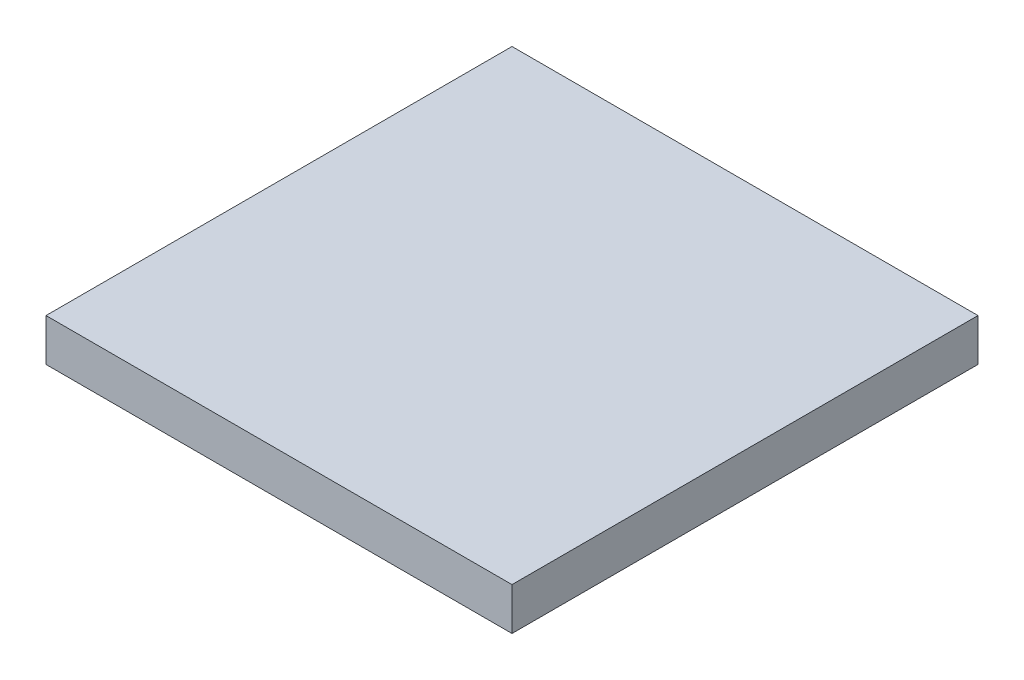
ISO-10303-21;
HEADER;
FILE_DESCRIPTION(('STEP AP214'),'2;1');
FILE_NAME('part.step','',(''),(''),'','','');
FILE_SCHEMA(('AUTOMOTIVE_DESIGN { 1 0 10303 214 1 1 1 1 }'));
ENDSEC;
DATA;
#1=APPLICATION_CONTEXT('core data for automotive mechanical design processes');
#2=APPLICATION_PROTOCOL_DEFINITION('international standard','automotive_design',2000,#1);
#3=PRODUCT_CONTEXT('',#1,'mechanical');
#4=PRODUCT('Part','Part','',(#3));
#5=PRODUCT_RELATED_PRODUCT_CATEGORY('part','',(#4));
#6=PRODUCT_DEFINITION_FORMATION('','',#4);
#7=PRODUCT_DEFINITION_CONTEXT('part definition',#1,'design');
#8=PRODUCT_DEFINITION('design','',#6,#7);
#9=PRODUCT_DEFINITION_SHAPE('','',#8);
#10=(LENGTH_UNIT() NAMED_UNIT(*) SI_UNIT(.MILLI.,.METRE.));
#11=(NAMED_UNIT(*) PLANE_ANGLE_UNIT() SI_UNIT($,.RADIAN.));
#12=(NAMED_UNIT(*) SI_UNIT($,.STERADIAN.) SOLID_ANGLE_UNIT());
#13=UNCERTAINTY_MEASURE_WITH_UNIT(LENGTH_MEASURE(1.E-05),#10,'distance_accuracy_value','');
#14=(GEOMETRIC_REPRESENTATION_CONTEXT(3) GLOBAL_UNCERTAINTY_ASSIGNED_CONTEXT((#13)) GLOBAL_UNIT_ASSIGNED_CONTEXT((#10,
#11,#12)) REPRESENTATION_CONTEXT('',''));
#15=CARTESIAN_POINT('',(0.,0.,0.));
#16=DIRECTION('',(0.,0.,1.));
#17=DIRECTION('',(1.,0.,0.));
#18=AXIS2_PLACEMENT_3D('',#15,#16,#17);
#19=CARTESIAN_POINT('',(8.25000000000001,1.5,16.5));
#20=DIRECTION('',(-1.,0.,0.));
#21=DIRECTION('',(0.,0.,1.));
#22=AXIS2_PLACEMENT_3D('',#19,#20,#21);
#23=PLANE('',#22);
#24=DIRECTION('',(0.,0.,-1.));
#25=VECTOR('',#24,1.);
#26=CARTESIAN_POINT('',(8.25000000000001,0.,16.5));
#27=LINE('',#26,#25);
#28=CARTESIAN_POINT('',(8.25000000000001,0.,16.5));
#29=VERTEX_POINT('',#28);
#30=CARTESIAN_POINT('',(8.25,0.,0.));
#31=VERTEX_POINT('',#30);
#32=EDGE_CURVE('E111',#29,#31,#27,.T.);
#33=ORIENTED_EDGE('',*,*,#32,.T.);
#34=DIRECTION('',(0.,-1.,0.));
#35=VECTOR('',#34,1.);
#36=CARTESIAN_POINT('',(8.25,1.5,0.));
#37=LINE('',#36,#35);
#38=CARTESIAN_POINT('',(8.25,1.5,0.));
#39=VERTEX_POINT('',#38);
#40=EDGE_CURVE('E11',#39,#31,#37,.T.);
#41=ORIENTED_EDGE('',*,*,#40,.F.);
#42=DIRECTION('',(0.,0.,-1.));
#43=VECTOR('',#42,1.);
#44=CARTESIAN_POINT('',(8.25000000000001,1.5,16.5));
#45=LINE('',#44,#43);
#46=CARTESIAN_POINT('',(8.25000000000001,1.5,16.5));
#47=VERTEX_POINT('',#46);
#48=EDGE_CURVE('E95',#47,#39,#45,.T.);
#49=ORIENTED_EDGE('',*,*,#48,.F.);
#50=DIRECTION('',(0.,-1.,0.));
#51=VECTOR('',#50,1.);
#52=CARTESIAN_POINT('',(8.25000000000001,1.5,16.5));
#53=LINE('',#52,#51);
#54=EDGE_CURVE('E107',#47,#29,#53,.T.);
#55=ORIENTED_EDGE('',*,*,#54,.T.);
#56=EDGE_LOOP('',(#33,#41,#49,#55));
#57=FACE_BOUND('',#56,.T.);
#58=ADVANCED_FACE('F43',(#57),#23,.F.);
#59=CARTESIAN_POINT('',(8.25,1.5,0.));
#60=DIRECTION('',(0.,0.,1.));
#61=DIRECTION('',(1.,0.,0.));
#62=AXIS2_PLACEMENT_3D('',#59,#60,#61);
#63=PLANE('',#62);
#64=DIRECTION('',(-1.,0.,0.));
#65=VECTOR('',#64,1.);
#66=CARTESIAN_POINT('',(8.25,0.,0.));
#67=LINE('',#66,#65);
#68=CARTESIAN_POINT('',(-8.25,0.,0.));
#69=VERTEX_POINT('',#68);
#70=EDGE_CURVE('E100',#31,#69,#67,.T.);
#71=ORIENTED_EDGE('',*,*,#70,.T.);
#72=DIRECTION('',(0.,-1.,0.));
#73=VECTOR('',#72,1.);
#74=CARTESIAN_POINT('',(-8.25,1.5,0.));
#75=LINE('',#74,#73);
#76=CARTESIAN_POINT('',(-8.25,1.5,0.));
#77=VERTEX_POINT('',#76);
#78=EDGE_CURVE('E52',#77,#69,#75,.T.);
#79=ORIENTED_EDGE('',*,*,#78,.F.);
#80=DIRECTION('',(-1.,0.,0.));
#81=VECTOR('',#80,1.);
#82=CARTESIAN_POINT('',(8.25,1.5,0.));
#83=LINE('',#82,#81);
#84=EDGE_CURVE('E90',#39,#77,#83,.T.);
#85=ORIENTED_EDGE('',*,*,#84,.F.);
#86=ORIENTED_EDGE('',*,*,#40,.T.);
#87=EDGE_LOOP('',(#71,#79,#85,#86));
#88=FACE_BOUND('',#87,.T.);
#89=ADVANCED_FACE('F99',(#88),#63,.F.);
#90=CARTESIAN_POINT('',(-8.25,1.5,0.));
#91=DIRECTION('',(1.,0.,0.));
#92=DIRECTION('',(0.,0.,-1.));
#93=AXIS2_PLACEMENT_3D('',#90,#91,#92);
#94=PLANE('',#93);
#95=DIRECTION('',(0.,0.,1.));
#96=VECTOR('',#95,1.);
#97=CARTESIAN_POINT('',(-8.25,0.,0.));
#98=LINE('',#97,#96);
#99=CARTESIAN_POINT('',(-8.25,0.,16.5));
#100=VERTEX_POINT('',#99);
#101=EDGE_CURVE('E77',#69,#100,#98,.T.);
#102=ORIENTED_EDGE('',*,*,#101,.T.);
#103=DIRECTION('',(0.,-1.,0.));
#104=VECTOR('',#103,1.);
#105=CARTESIAN_POINT('',(-8.25,1.5,16.5));
#106=LINE('',#105,#104);
#107=CARTESIAN_POINT('',(-8.25,1.5,16.5));
#108=VERTEX_POINT('',#107);
#109=EDGE_CURVE('E102',#108,#100,#106,.T.);
#110=ORIENTED_EDGE('',*,*,#109,.F.);
#111=DIRECTION('',(0.,0.,1.));
#112=VECTOR('',#111,1.);
#113=CARTESIAN_POINT('',(-8.25,1.5,0.));
#114=LINE('',#113,#112);
#115=EDGE_CURVE('E93',#77,#108,#114,.T.);
#116=ORIENTED_EDGE('',*,*,#115,.F.);
#117=ORIENTED_EDGE('',*,*,#78,.T.);
#118=EDGE_LOOP('',(#102,#110,#116,#117));
#119=FACE_BOUND('',#118,.T.);
#120=ADVANCED_FACE('F103',(#119),#94,.F.);
#121=CARTESIAN_POINT('',(-8.25,1.5,16.5));
#122=DIRECTION('',(0.,0.,-1.));
#123=DIRECTION('',(-1.,0.,0.));
#124=AXIS2_PLACEMENT_3D('',#121,#122,#123);
#125=PLANE('',#124);
#126=DIRECTION('',(1.,0.,0.));
#127=VECTOR('',#126,1.);
#128=CARTESIAN_POINT('',(-8.25,0.,16.5));
#129=LINE('',#128,#127);
#130=EDGE_CURVE('E83',#100,#29,#129,.T.);
#131=ORIENTED_EDGE('',*,*,#130,.T.);
#132=ORIENTED_EDGE('',*,*,#54,.F.);
#133=DIRECTION('',(1.,0.,0.));
#134=VECTOR('',#133,1.);
#135=CARTESIAN_POINT('',(-8.25,1.5,16.5));
#136=LINE('',#135,#134);
#137=EDGE_CURVE('E60',#108,#47,#136,.T.);
#138=ORIENTED_EDGE('',*,*,#137,.F.);
#139=ORIENTED_EDGE('',*,*,#109,.T.);
#140=EDGE_LOOP('',(#131,#132,#138,#139));
#141=FACE_BOUND('',#140,.T.);
#142=ADVANCED_FACE('F124',(#141),#125,.F.);
#143=CARTESIAN_POINT('',(0.,1.5,0.));
#144=DIRECTION('',(0.,1.,0.));
#145=DIRECTION('',(0.,0.,1.));
#146=AXIS2_PLACEMENT_3D('',#143,#144,#145);
#147=PLANE('',#146);
#148=ORIENTED_EDGE('',*,*,#48,.T.);
#149=ORIENTED_EDGE('',*,*,#84,.T.);
#150=ORIENTED_EDGE('',*,*,#115,.T.);
#151=ORIENTED_EDGE('',*,*,#137,.T.);
#152=EDGE_LOOP('',(#148,#149,#150,#151));
#153=FACE_BOUND('',#152,.T.);
#154=ADVANCED_FACE('F91',(#153),#147,.T.);
#155=CARTESIAN_POINT('',(0.,0.,0.));
#156=DIRECTION('',(0.,1.,0.));
#157=DIRECTION('',(0.,0.,1.));
#158=AXIS2_PLACEMENT_3D('',#155,#156,#157);
#159=PLANE('',#158);
#160=ORIENTED_EDGE('',*,*,#32,.F.);
#161=ORIENTED_EDGE('',*,*,#130,.F.);
#162=ORIENTED_EDGE('',*,*,#101,.F.);
#163=ORIENTED_EDGE('',*,*,#70,.F.);
#164=EDGE_LOOP('',(#160,#161,#162,#163));
#165=FACE_BOUND('',#164,.T.);
#166=ADVANCED_FACE('F127',(#165),#159,.F.);
#167=CLOSED_SHELL('',(#58,#89,#120,#142,#154,#166));
#168=MANIFOLD_SOLID_BREP('B2',#167);
#169=ADVANCED_BREP_SHAPE_REPRESENTATION('',(#18,#168),#14);
#170=SHAPE_DEFINITION_REPRESENTATION(#9,#169);
ENDSEC;
END-ISO-10303-21;
